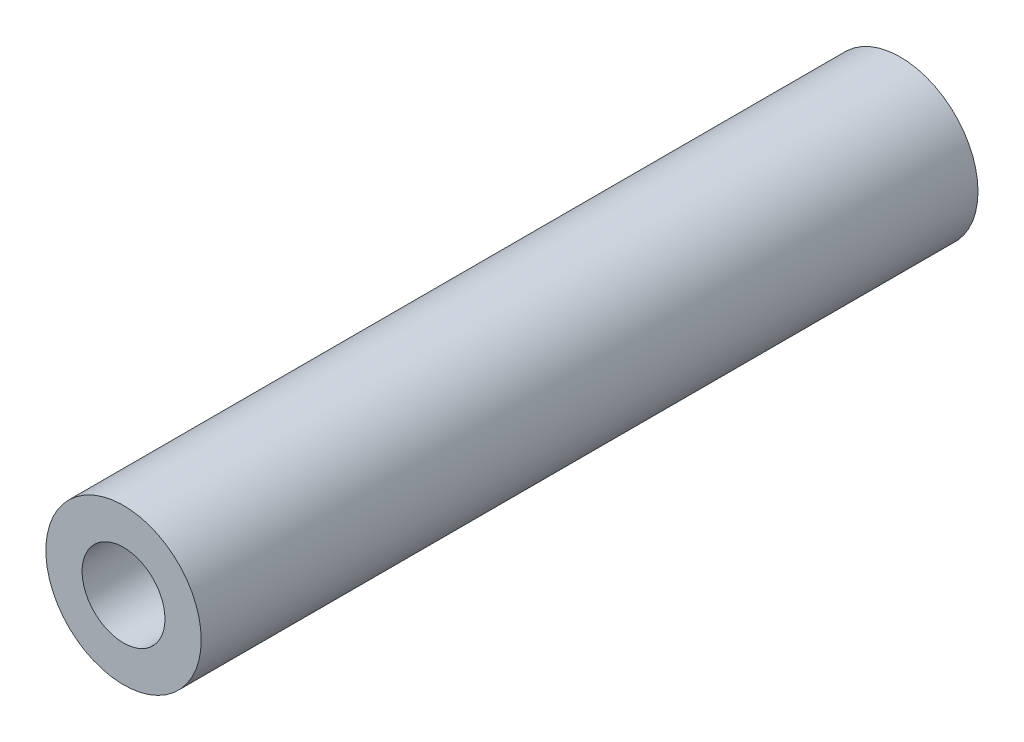
ISO-10303-21;
HEADER;
FILE_DESCRIPTION(('STEP AP214'),'2;1');
FILE_NAME('part.step','',(''),(''),'','','');
FILE_SCHEMA(('AUTOMOTIVE_DESIGN { 1 0 10303 214 1 1 1 1 }'));
ENDSEC;
DATA;
#1=APPLICATION_CONTEXT('core data for automotive mechanical design processes');
#2=APPLICATION_PROTOCOL_DEFINITION('international standard','automotive_design',2000,#1);
#3=PRODUCT_CONTEXT('',#1,'mechanical');
#4=PRODUCT('Part','Part','',(#3));
#5=PRODUCT_RELATED_PRODUCT_CATEGORY('part','',(#4));
#6=PRODUCT_DEFINITION_FORMATION('','',#4);
#7=PRODUCT_DEFINITION_CONTEXT('part definition',#1,'design');
#8=PRODUCT_DEFINITION('design','',#6,#7);
#9=PRODUCT_DEFINITION_SHAPE('','',#8);
#10=(LENGTH_UNIT() NAMED_UNIT(*) SI_UNIT(.MILLI.,.METRE.));
#11=(NAMED_UNIT(*) PLANE_ANGLE_UNIT() SI_UNIT($,.RADIAN.));
#12=(NAMED_UNIT(*) SI_UNIT($,.STERADIAN.) SOLID_ANGLE_UNIT());
#13=UNCERTAINTY_MEASURE_WITH_UNIT(LENGTH_MEASURE(1.E-05),#10,'distance_accuracy_value','');
#14=(GEOMETRIC_REPRESENTATION_CONTEXT(3) GLOBAL_UNCERTAINTY_ASSIGNED_CONTEXT((#13)) GLOBAL_UNIT_ASSIGNED_CONTEXT((#10,
#11,#12)) REPRESENTATION_CONTEXT('',''));
#15=CARTESIAN_POINT('',(0.,0.,0.));
#16=DIRECTION('',(0.,0.,1.));
#17=DIRECTION('',(1.,0.,0.));
#18=AXIS2_PLACEMENT_3D('',#15,#16,#17);
#19=CARTESIAN_POINT('',(0.,0.,15.));
#20=DIRECTION('',(0.,0.,1.));
#21=DIRECTION('',(1.,0.,0.));
#22=AXIS2_PLACEMENT_3D('',#19,#20,#21);
#23=PLANE('',#22);
#24=CARTESIAN_POINT('',(0.,0.,15.));
#25=DIRECTION('',(0.,0.,1.));
#26=DIRECTION('',(1.,0.,0.));
#27=AXIS2_PLACEMENT_3D('',#24,#25,#26);
#28=CIRCLE('',#27,3.);
#29=CARTESIAN_POINT('',(3.,0.,15.));
#30=VERTEX_POINT('',#29);
#31=EDGE_CURVE('E10',#30,#30,#28,.T.);
#32=ORIENTED_EDGE('',*,*,#31,.T.);
#33=EDGE_LOOP('',(#32));
#34=FACE_BOUND('',#33,.T.);
#35=CARTESIAN_POINT('',(0.,0.,15.));
#36=DIRECTION('',(0.,0.,1.));
#37=DIRECTION('',(1.,0.,0.));
#38=AXIS2_PLACEMENT_3D('',#35,#36,#37);
#39=CIRCLE('',#38,1.6);
#40=CARTESIAN_POINT('',(1.6,0.,15.));
#41=VERTEX_POINT('',#40);
#42=EDGE_CURVE('E37',#41,#41,#39,.T.);
#43=ORIENTED_EDGE('',*,*,#42,.F.);
#44=EDGE_LOOP('',(#43));
#45=FACE_BOUND('',#44,.T.);
#46=ADVANCED_FACE('F30',(#34,#45),#23,.T.);
#47=CARTESIAN_POINT('',(0.,0.,15.));
#48=DIRECTION('',(0.,0.,-1.));
#49=DIRECTION('',(-1.,0.,0.));
#50=AXIS2_PLACEMENT_3D('',#47,#48,#49);
#51=CYLINDRICAL_SURFACE('',#50,3.);
#52=ORIENTED_EDGE('',*,*,#31,.F.);
#53=EDGE_LOOP('',(#52));
#54=FACE_BOUND('',#53,.T.);
#55=CARTESIAN_POINT('',(0.,0.,-15.));
#56=DIRECTION('',(0.,0.,1.));
#57=DIRECTION('',(1.,0.,0.));
#58=AXIS2_PLACEMENT_3D('',#55,#56,#57);
#59=CIRCLE('',#58,3.);
#60=CARTESIAN_POINT('',(3.,0.,-15.));
#61=VERTEX_POINT('',#60);
#62=EDGE_CURVE('E41',#61,#61,#59,.T.);
#63=ORIENTED_EDGE('',*,*,#62,.T.);
#64=EDGE_LOOP('',(#63));
#65=FACE_BOUND('',#64,.T.);
#66=ADVANCED_FACE('F32',(#54,#65),#51,.T.);
#67=CARTESIAN_POINT('',(0.,0.,15.));
#68=DIRECTION('',(0.,0.,-1.));
#69=DIRECTION('',(-1.,0.,0.));
#70=AXIS2_PLACEMENT_3D('',#67,#68,#69);
#71=CYLINDRICAL_SURFACE('',#70,1.6);
#72=ORIENTED_EDGE('',*,*,#42,.T.);
#73=EDGE_LOOP('',(#72));
#74=FACE_BOUND('',#73,.T.);
#75=CARTESIAN_POINT('',(0.,0.,-15.));
#76=DIRECTION('',(0.,0.,1.));
#77=DIRECTION('',(1.,0.,0.));
#78=AXIS2_PLACEMENT_3D('',#75,#76,#77);
#79=CIRCLE('',#78,1.6);
#80=CARTESIAN_POINT('',(1.6,0.,-15.));
#81=VERTEX_POINT('',#80);
#82=EDGE_CURVE('E45',#81,#81,#79,.T.);
#83=ORIENTED_EDGE('',*,*,#82,.F.);
#84=EDGE_LOOP('',(#83));
#85=FACE_BOUND('',#84,.T.);
#86=ADVANCED_FACE('F54',(#74,#85),#71,.F.);
#87=CARTESIAN_POINT('',(0.,0.,-15.));
#88=DIRECTION('',(0.,0.,1.));
#89=DIRECTION('',(1.,0.,0.));
#90=AXIS2_PLACEMENT_3D('',#87,#88,#89);
#91=PLANE('',#90);
#92=ORIENTED_EDGE('',*,*,#82,.T.);
#93=EDGE_LOOP('',(#92));
#94=FACE_BOUND('',#93,.T.);
#95=ORIENTED_EDGE('',*,*,#62,.F.);
#96=EDGE_LOOP('',(#95));
#97=FACE_BOUND('',#96,.T.);
#98=ADVANCED_FACE('F51',(#94,#97),#91,.F.);
#99=CLOSED_SHELL('',(#46,#66,#86,#98));
#100=MANIFOLD_SOLID_BREP('B2',#99);
#101=ADVANCED_BREP_SHAPE_REPRESENTATION('',(#18,#100),#14);
#102=SHAPE_DEFINITION_REPRESENTATION(#9,#101);
ENDSEC;
END-ISO-10303-21;
